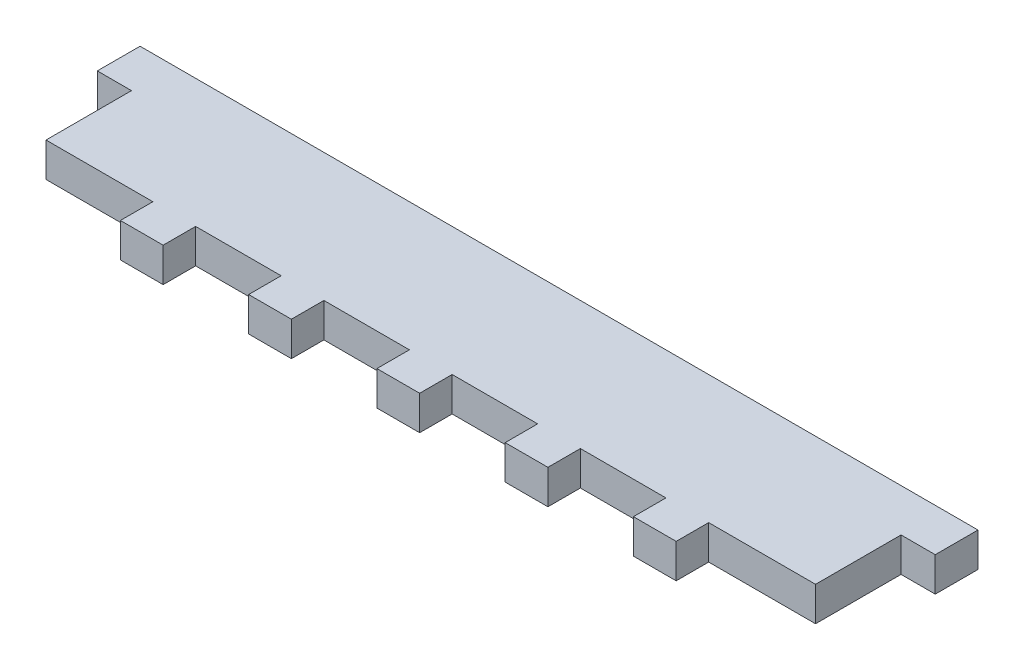
ISO-10303-21;
HEADER;
FILE_DESCRIPTION(('STEP AP214'),'2;1');
FILE_NAME('part.step','',(''),(''),'','','');
FILE_SCHEMA(('AUTOMOTIVE_DESIGN { 1 0 10303 214 1 1 1 1 }'));
ENDSEC;
DATA;
#1=APPLICATION_CONTEXT('core data for automotive mechanical design processes');
#2=APPLICATION_PROTOCOL_DEFINITION('international standard','automotive_design',2000,#1);
#3=PRODUCT_CONTEXT('',#1,'mechanical');
#4=PRODUCT('Part','Part','',(#3));
#5=PRODUCT_RELATED_PRODUCT_CATEGORY('part','',(#4));
#6=PRODUCT_DEFINITION_FORMATION('','',#4);
#7=PRODUCT_DEFINITION_CONTEXT('part definition',#1,'design');
#8=PRODUCT_DEFINITION('design','',#6,#7);
#9=PRODUCT_DEFINITION_SHAPE('','',#8);
#10=(LENGTH_UNIT() NAMED_UNIT(*) SI_UNIT(.MILLI.,.METRE.));
#11=(NAMED_UNIT(*) PLANE_ANGLE_UNIT() SI_UNIT($,.RADIAN.));
#12=(NAMED_UNIT(*) SI_UNIT($,.STERADIAN.) SOLID_ANGLE_UNIT());
#13=UNCERTAINTY_MEASURE_WITH_UNIT(LENGTH_MEASURE(1.E-05),#10,'distance_accuracy_value','');
#14=(GEOMETRIC_REPRESENTATION_CONTEXT(3) GLOBAL_UNCERTAINTY_ASSIGNED_CONTEXT((#13)) GLOBAL_UNIT_ASSIGNED_CONTEXT((#10,
#11,#12)) REPRESENTATION_CONTEXT('',''));
#15=CARTESIAN_POINT('',(0.,0.,0.));
#16=DIRECTION('',(0.,0.,1.));
#17=DIRECTION('',(1.,0.,0.));
#18=AXIS2_PLACEMENT_3D('',#15,#16,#17);
#19=CARTESIAN_POINT('',(0.,5.08,0.));
#20=DIRECTION('',(0.,0.,-1.));
#21=DIRECTION('',(-1.,0.,0.));
#22=AXIS2_PLACEMENT_3D('',#19,#20,#21);
#23=PLANE('',#22);
#24=DIRECTION('',(0.,-1.,0.));
#25=VECTOR('',#24,1.);
#26=CARTESIAN_POINT('',(92.075,5.08,0.));
#27=LINE('',#26,#25);
#28=CARTESIAN_POINT('',(92.075,5.08,0.));
#29=VERTEX_POINT('',#28);
#30=CARTESIAN_POINT('',(92.075,0.,0.));
#31=VERTEX_POINT('',#30);
#32=EDGE_CURVE('E56',#29,#31,#27,.T.);
#33=ORIENTED_EDGE('',*,*,#32,.F.);
#34=DIRECTION('',(1.,0.,0.));
#35=VECTOR('',#34,1.);
#36=CARTESIAN_POINT('',(0.,5.08,0.));
#37=LINE('',#36,#35);
#38=CARTESIAN_POINT('',(79.375,5.08,0.));
#39=VERTEX_POINT('',#38);
#40=EDGE_CURVE('E433',#39,#29,#37,.T.);
#41=ORIENTED_EDGE('',*,*,#40,.F.);
#42=DIRECTION('',(0.,1.,0.));
#43=VECTOR('',#42,1.);
#44=CARTESIAN_POINT('',(79.375,5.08,0.));
#45=LINE('',#44,#43);
#46=CARTESIAN_POINT('',(79.375,0.,0.));
#47=VERTEX_POINT('',#46);
#48=EDGE_CURVE('E245',#47,#39,#45,.T.);
#49=ORIENTED_EDGE('',*,*,#48,.F.);
#50=DIRECTION('',(1.,0.,0.));
#51=VECTOR('',#50,1.);
#52=CARTESIAN_POINT('',(0.,0.,0.));
#53=LINE('',#52,#51);
#54=EDGE_CURVE('E490',#47,#31,#53,.T.);
#55=ORIENTED_EDGE('',*,*,#54,.T.);
#56=EDGE_LOOP('',(#33,#41,#49,#55));
#57=FACE_BOUND('',#56,.T.);
#58=ADVANCED_FACE('F33',(#57),#23,.F.);
#59=DIRECTION('',(0.,1.,0.));
#60=VECTOR('',#59,1.);
#61=CARTESIAN_POINT('',(98.425,5.08,0.));
#62=LINE('',#61,#60);
#63=CARTESIAN_POINT('',(98.425,0.,0.));
#64=VERTEX_POINT('',#63);
#65=CARTESIAN_POINT('',(98.425,5.08,0.));
#66=VERTEX_POINT('',#65);
#67=EDGE_CURVE('E239',#64,#66,#62,.T.);
#68=ORIENTED_EDGE('',*,*,#67,.F.);
#69=CARTESIAN_POINT('',(114.3,0.,0.));
#70=VERTEX_POINT('',#69);
#71=EDGE_CURVE('E379',#64,#70,#53,.T.);
#72=ORIENTED_EDGE('',*,*,#71,.T.);
#73=DIRECTION('',(0.,-1.,0.));
#74=VECTOR('',#73,1.);
#75=CARTESIAN_POINT('',(114.3,5.08,0.));
#76=LINE('',#75,#74);
#77=CARTESIAN_POINT('',(114.3,5.08,0.));
#78=VERTEX_POINT('',#77);
#79=EDGE_CURVE('E41',#78,#70,#76,.T.);
#80=ORIENTED_EDGE('',*,*,#79,.F.);
#81=EDGE_CURVE('E48',#66,#78,#37,.T.);
#82=ORIENTED_EDGE('',*,*,#81,.F.);
#83=EDGE_LOOP('',(#68,#72,#80,#82));
#84=FACE_BOUND('',#83,.T.);
#85=ADVANCED_FACE('F491',(#84),#23,.F.);
#86=DIRECTION('',(0.,-1.,0.));
#87=VECTOR('',#86,1.);
#88=CARTESIAN_POINT('',(73.025,5.08,0.));
#89=LINE('',#88,#87);
#90=CARTESIAN_POINT('',(73.025,5.08,0.));
#91=VERTEX_POINT('',#90);
#92=CARTESIAN_POINT('',(73.025,0.,0.));
#93=VERTEX_POINT('',#92);
#94=EDGE_CURVE('E242',#91,#93,#89,.T.);
#95=ORIENTED_EDGE('',*,*,#94,.F.);
#96=CARTESIAN_POINT('',(60.325,5.08,0.));
#97=VERTEX_POINT('',#96);
#98=EDGE_CURVE('E434',#97,#91,#37,.T.);
#99=ORIENTED_EDGE('',*,*,#98,.F.);
#100=DIRECTION('',(0.,1.,0.));
#101=VECTOR('',#100,1.);
#102=CARTESIAN_POINT('',(60.325,5.08,0.));
#103=LINE('',#102,#101);
#104=CARTESIAN_POINT('',(60.325,0.,0.));
#105=VERTEX_POINT('',#104);
#106=EDGE_CURVE('E279',#105,#97,#103,.T.);
#107=ORIENTED_EDGE('',*,*,#106,.F.);
#108=EDGE_CURVE('E476',#105,#93,#53,.T.);
#109=ORIENTED_EDGE('',*,*,#108,.T.);
#110=EDGE_LOOP('',(#95,#99,#107,#109));
#111=FACE_BOUND('',#110,.T.);
#112=ADVANCED_FACE('F475',(#111),#23,.F.);
#113=DIRECTION('',(0.,-1.,0.));
#114=VECTOR('',#113,1.);
#115=CARTESIAN_POINT('',(53.975,5.08,0.));
#116=LINE('',#115,#114);
#117=CARTESIAN_POINT('',(53.975,5.08,0.));
#118=VERTEX_POINT('',#117);
#119=CARTESIAN_POINT('',(53.975,0.,0.));
#120=VERTEX_POINT('',#119);
#121=EDGE_CURVE('E274',#118,#120,#116,.T.);
#122=ORIENTED_EDGE('',*,*,#121,.F.);
#123=CARTESIAN_POINT('',(41.275,5.08,0.));
#124=VERTEX_POINT('',#123);
#125=EDGE_CURVE('E436',#124,#118,#37,.T.);
#126=ORIENTED_EDGE('',*,*,#125,.F.);
#127=DIRECTION('',(0.,1.,0.));
#128=VECTOR('',#127,1.);
#129=CARTESIAN_POINT('',(41.275,5.08,0.));
#130=LINE('',#129,#128);
#131=CARTESIAN_POINT('',(41.275,0.,0.));
#132=VERTEX_POINT('',#131);
#133=EDGE_CURVE('E306',#132,#124,#130,.T.);
#134=ORIENTED_EDGE('',*,*,#133,.F.);
#135=EDGE_CURVE('E460',#132,#120,#53,.T.);
#136=ORIENTED_EDGE('',*,*,#135,.T.);
#137=EDGE_LOOP('',(#122,#126,#134,#136));
#138=FACE_BOUND('',#137,.T.);
#139=ADVANCED_FACE('F459',(#138),#23,.F.);
#140=DIRECTION('',(0.,-1.,0.));
#141=VECTOR('',#140,1.);
#142=CARTESIAN_POINT('',(34.925,5.08,0.));
#143=LINE('',#142,#141);
#144=CARTESIAN_POINT('',(34.925,5.08,0.));
#145=VERTEX_POINT('',#144);
#146=CARTESIAN_POINT('',(34.925,0.,0.));
#147=VERTEX_POINT('',#146);
#148=EDGE_CURVE('E301',#145,#147,#143,.T.);
#149=ORIENTED_EDGE('',*,*,#148,.F.);
#150=CARTESIAN_POINT('',(22.225,5.08,0.));
#151=VERTEX_POINT('',#150);
#152=EDGE_CURVE('E364',#151,#145,#37,.T.);
#153=ORIENTED_EDGE('',*,*,#152,.F.);
#154=DIRECTION('',(0.,1.,0.));
#155=VECTOR('',#154,1.);
#156=CARTESIAN_POINT('',(22.225,5.08,0.));
#157=LINE('',#156,#155);
#158=CARTESIAN_POINT('',(22.225,0.,0.));
#159=VERTEX_POINT('',#158);
#160=EDGE_CURVE('E333',#159,#151,#157,.T.);
#161=ORIENTED_EDGE('',*,*,#160,.F.);
#162=EDGE_CURVE('E383',#159,#147,#53,.T.);
#163=ORIENTED_EDGE('',*,*,#162,.T.);
#164=EDGE_LOOP('',(#149,#153,#161,#163));
#165=FACE_BOUND('',#164,.T.);
#166=ADVANCED_FACE('F515',(#165),#23,.F.);
#167=DIRECTION('',(0.,-1.,0.));
#168=VECTOR('',#167,1.);
#169=CARTESIAN_POINT('',(15.875,5.08,0.));
#170=LINE('',#169,#168);
#171=CARTESIAN_POINT('',(15.875,5.08,0.));
#172=VERTEX_POINT('',#171);
#173=CARTESIAN_POINT('',(15.875,0.,0.));
#174=VERTEX_POINT('',#173);
#175=EDGE_CURVE('E328',#172,#174,#170,.T.);
#176=ORIENTED_EDGE('',*,*,#175,.F.);
#177=CARTESIAN_POINT('',(0.,5.08,0.));
#178=VERTEX_POINT('',#177);
#179=EDGE_CURVE('E360',#178,#172,#37,.T.);
#180=ORIENTED_EDGE('',*,*,#179,.F.);
#181=DIRECTION('',(0.,-1.,0.));
#182=VECTOR('',#181,1.);
#183=CARTESIAN_POINT('',(0.,5.08,0.));
#184=LINE('',#183,#182);
#185=CARTESIAN_POINT('',(0.,0.,0.));
#186=VERTEX_POINT('',#185);
#187=EDGE_CURVE('E11',#178,#186,#184,.T.);
#188=ORIENTED_EDGE('',*,*,#187,.T.);
#189=EDGE_CURVE('E380',#186,#174,#53,.T.);
#190=ORIENTED_EDGE('',*,*,#189,.T.);
#191=EDGE_LOOP('',(#176,#180,#188,#190));
#192=FACE_BOUND('',#191,.T.);
#193=ADVANCED_FACE('F509',(#192),#23,.F.);
#194=CARTESIAN_POINT('',(0.,5.08,0.));
#195=DIRECTION('',(1.,0.,0.));
#196=DIRECTION('',(0.,0.,-1.));
#197=AXIS2_PLACEMENT_3D('',#194,#195,#196);
#198=PLANE('',#197);
#199=DIRECTION('',(0.,0.,1.));
#200=VECTOR('',#199,1.);
#201=CARTESIAN_POINT('',(0.,0.,0.));
#202=LINE('',#201,#200);
#203=CARTESIAN_POINT('',(0.,0.,-12.7));
#204=VERTEX_POINT('',#203);
#205=EDGE_CURVE('E355',#204,#186,#202,.T.);
#206=ORIENTED_EDGE('',*,*,#205,.T.);
#207=ORIENTED_EDGE('',*,*,#187,.F.);
#208=DIRECTION('',(0.,0.,1.));
#209=VECTOR('',#208,1.);
#210=CARTESIAN_POINT('',(0.,5.08,0.));
#211=LINE('',#210,#209);
#212=CARTESIAN_POINT('',(0.,5.08,-12.7));
#213=VERTEX_POINT('',#212);
#214=EDGE_CURVE('E356',#213,#178,#211,.T.);
#215=ORIENTED_EDGE('',*,*,#214,.F.);
#216=DIRECTION('',(0.,-1.,0.));
#217=VECTOR('',#216,1.);
#218=CARTESIAN_POINT('',(0.,5.08,-12.7));
#219=LINE('',#218,#217);
#220=EDGE_CURVE('E376',#213,#204,#219,.T.);
#221=ORIENTED_EDGE('',*,*,#220,.T.);
#222=EDGE_LOOP('',(#206,#207,#215,#221));
#223=FACE_BOUND('',#222,.T.);
#224=ADVANCED_FACE('F35',(#223),#198,.F.);
#225=CARTESIAN_POINT('',(114.3,5.08,0.));
#226=DIRECTION('',(-1.,0.,0.));
#227=DIRECTION('',(0.,0.,1.));
#228=AXIS2_PLACEMENT_3D('',#225,#226,#227);
#229=PLANE('',#228);
#230=DIRECTION('',(0.,0.,-1.));
#231=VECTOR('',#230,1.);
#232=CARTESIAN_POINT('',(114.3,0.,0.));
#233=LINE('',#232,#231);
#234=CARTESIAN_POINT('',(114.3,0.,-12.7));
#235=VERTEX_POINT('',#234);
#236=EDGE_CURVE('E382',#70,#235,#233,.T.);
#237=ORIENTED_EDGE('',*,*,#236,.T.);
#238=DIRECTION('',(0.,-1.,0.));
#239=VECTOR('',#238,1.);
#240=CARTESIAN_POINT('',(114.3,5.08,-12.7));
#241=LINE('',#240,#239);
#242=CARTESIAN_POINT('',(114.3,5.08,-12.7));
#243=VERTEX_POINT('',#242);
#244=EDGE_CURVE('E409',#243,#235,#241,.T.);
#245=ORIENTED_EDGE('',*,*,#244,.F.);
#246=DIRECTION('',(0.,0.,-1.));
#247=VECTOR('',#246,1.);
#248=CARTESIAN_POINT('',(114.3,5.08,0.));
#249=LINE('',#248,#247);
#250=EDGE_CURVE('E363',#78,#243,#249,.T.);
#251=ORIENTED_EDGE('',*,*,#250,.F.);
#252=ORIENTED_EDGE('',*,*,#79,.T.);
#253=EDGE_LOOP('',(#237,#245,#251,#252));
#254=FACE_BOUND('',#253,.T.);
#255=ADVANCED_FACE('F415',(#254),#229,.F.);
#256=CARTESIAN_POINT('',(114.3,5.08,-12.7));
#257=DIRECTION('',(0.,0.,-1.));
#258=DIRECTION('',(-1.,0.,0.));
#259=AXIS2_PLACEMENT_3D('',#256,#257,#258);
#260=PLANE('',#259);
#261=DIRECTION('',(1.,0.,0.));
#262=VECTOR('',#261,1.);
#263=CARTESIAN_POINT('',(114.3,0.,-12.7));
#264=LINE('',#263,#262);
#265=CARTESIAN_POINT('',(119.38,0.,-12.7));
#266=VERTEX_POINT('',#265);
#267=EDGE_CURVE('E385',#235,#266,#264,.T.);
#268=ORIENTED_EDGE('',*,*,#267,.T.);
#269=DIRECTION('',(0.,-1.,0.));
#270=VECTOR('',#269,1.);
#271=CARTESIAN_POINT('',(119.38,5.08,-12.7));
#272=LINE('',#271,#270);
#273=CARTESIAN_POINT('',(119.38,5.08,-12.7));
#274=VERTEX_POINT('',#273);
#275=EDGE_CURVE('E406',#274,#266,#272,.T.);
#276=ORIENTED_EDGE('',*,*,#275,.F.);
#277=DIRECTION('',(1.,0.,0.));
#278=VECTOR('',#277,1.);
#279=CARTESIAN_POINT('',(114.3,5.08,-12.7));
#280=LINE('',#279,#278);
#281=EDGE_CURVE('E366',#243,#274,#280,.T.);
#282=ORIENTED_EDGE('',*,*,#281,.F.);
#283=ORIENTED_EDGE('',*,*,#244,.T.);
#284=EDGE_LOOP('',(#268,#276,#282,#283));
#285=FACE_BOUND('',#284,.T.);
#286=ADVANCED_FACE('F421',(#285),#260,.F.);
#287=CARTESIAN_POINT('',(119.38,5.08,-19.05));
#288=DIRECTION('',(-1.,0.,0.));
#289=DIRECTION('',(0.,0.,1.));
#290=AXIS2_PLACEMENT_3D('',#287,#288,#289);
#291=PLANE('',#290);
#292=DIRECTION('',(0.,0.,-1.));
#293=VECTOR('',#292,1.);
#294=CARTESIAN_POINT('',(119.38,0.,-19.05));
#295=LINE('',#294,#293);
#296=CARTESIAN_POINT('',(119.38,0.,-19.05));
#297=VERTEX_POINT('',#296);
#298=EDGE_CURVE('E387',#266,#297,#295,.T.);
#299=ORIENTED_EDGE('',*,*,#298,.T.);
#300=DIRECTION('',(0.,-1.,0.));
#301=VECTOR('',#300,1.);
#302=CARTESIAN_POINT('',(119.38,5.08,-19.05));
#303=LINE('',#302,#301);
#304=CARTESIAN_POINT('',(119.38,5.08,-19.05));
#305=VERTEX_POINT('',#304);
#306=EDGE_CURVE('E403',#305,#297,#303,.T.);
#307=ORIENTED_EDGE('',*,*,#306,.F.);
#308=DIRECTION('',(0.,0.,-1.));
#309=VECTOR('',#308,1.);
#310=CARTESIAN_POINT('',(119.38,5.08,-19.05));
#311=LINE('',#310,#309);
#312=EDGE_CURVE('E368',#274,#305,#311,.T.);
#313=ORIENTED_EDGE('',*,*,#312,.F.);
#314=ORIENTED_EDGE('',*,*,#275,.T.);
#315=EDGE_LOOP('',(#299,#307,#313,#314));
#316=FACE_BOUND('',#315,.T.);
#317=ADVANCED_FACE('F425',(#316),#291,.F.);
#318=CARTESIAN_POINT('',(0.,5.08,-19.05));
#319=DIRECTION('',(0.,0.,1.));
#320=DIRECTION('',(1.,0.,0.));
#321=AXIS2_PLACEMENT_3D('',#318,#319,#320);
#322=PLANE('',#321);
#323=DIRECTION('',(-1.,0.,0.));
#324=VECTOR('',#323,1.);
#325=CARTESIAN_POINT('',(0.,0.,-19.05));
#326=LINE('',#325,#324);
#327=CARTESIAN_POINT('',(-5.08,0.,-19.05));
#328=VERTEX_POINT('',#327);
#329=EDGE_CURVE('E390',#297,#328,#326,.T.);
#330=ORIENTED_EDGE('',*,*,#329,.T.);
#331=DIRECTION('',(0.,-1.,0.));
#332=VECTOR('',#331,1.);
#333=CARTESIAN_POINT('',(-5.08,5.08,-19.05));
#334=LINE('',#333,#332);
#335=CARTESIAN_POINT('',(-5.08,5.08,-19.05));
#336=VERTEX_POINT('',#335);
#337=EDGE_CURVE('E400',#336,#328,#334,.T.);
#338=ORIENTED_EDGE('',*,*,#337,.F.);
#339=DIRECTION('',(-1.,0.,0.));
#340=VECTOR('',#339,1.);
#341=CARTESIAN_POINT('',(114.3,5.08,-19.05));
#342=LINE('',#341,#340);
#343=EDGE_CURVE('E370',#305,#336,#342,.T.);
#344=ORIENTED_EDGE('',*,*,#343,.F.);
#345=ORIENTED_EDGE('',*,*,#306,.T.);
#346=EDGE_LOOP('',(#330,#338,#344,#345));
#347=FACE_BOUND('',#346,.T.);
#348=ADVANCED_FACE('F547',(#347),#322,.F.);
#349=CARTESIAN_POINT('',(-5.08,5.08,-19.05));
#350=DIRECTION('',(1.,0.,0.));
#351=DIRECTION('',(0.,0.,-1.));
#352=AXIS2_PLACEMENT_3D('',#349,#350,#351);
#353=PLANE('',#352);
#354=DIRECTION('',(0.,0.,1.));
#355=VECTOR('',#354,1.);
#356=CARTESIAN_POINT('',(-5.08,0.,-19.05));
#357=LINE('',#356,#355);
#358=CARTESIAN_POINT('',(-5.08,0.,-12.7));
#359=VERTEX_POINT('',#358);
#360=EDGE_CURVE('E392',#328,#359,#357,.T.);
#361=ORIENTED_EDGE('',*,*,#360,.T.);
#362=DIRECTION('',(0.,-1.,0.));
#363=VECTOR('',#362,1.);
#364=CARTESIAN_POINT('',(-5.08,5.08,-12.7));
#365=LINE('',#364,#363);
#366=CARTESIAN_POINT('',(-5.08,5.08,-12.7));
#367=VERTEX_POINT('',#366);
#368=EDGE_CURVE('E397',#367,#359,#365,.T.);
#369=ORIENTED_EDGE('',*,*,#368,.F.);
#370=DIRECTION('',(0.,0.,1.));
#371=VECTOR('',#370,1.);
#372=CARTESIAN_POINT('',(-5.08,5.08,-19.05));
#373=LINE('',#372,#371);
#374=EDGE_CURVE('E372',#336,#367,#373,.T.);
#375=ORIENTED_EDGE('',*,*,#374,.F.);
#376=ORIENTED_EDGE('',*,*,#337,.T.);
#377=EDGE_LOOP('',(#361,#369,#375,#376));
#378=FACE_BOUND('',#377,.T.);
#379=ADVANCED_FACE('F544',(#378),#353,.F.);
#380=CARTESIAN_POINT('',(0.,5.08,-12.7));
#381=DIRECTION('',(0.,0.,-1.));
#382=DIRECTION('',(-1.,0.,0.));
#383=AXIS2_PLACEMENT_3D('',#380,#381,#382);
#384=PLANE('',#383);
#385=DIRECTION('',(1.,0.,0.));
#386=VECTOR('',#385,1.);
#387=CARTESIAN_POINT('',(0.,0.,-12.7));
#388=LINE('',#387,#386);
#389=EDGE_CURVE('E359',#359,#204,#388,.T.);
#390=ORIENTED_EDGE('',*,*,#389,.T.);
#391=ORIENTED_EDGE('',*,*,#220,.F.);
#392=DIRECTION('',(1.,0.,0.));
#393=VECTOR('',#392,1.);
#394=CARTESIAN_POINT('',(0.,5.08,-12.7));
#395=LINE('',#394,#393);
#396=EDGE_CURVE('E374',#367,#213,#395,.T.);
#397=ORIENTED_EDGE('',*,*,#396,.F.);
#398=ORIENTED_EDGE('',*,*,#368,.T.);
#399=EDGE_LOOP('',(#390,#391,#397,#398));
#400=FACE_BOUND('',#399,.T.);
#401=ADVANCED_FACE('F540',(#400),#384,.F.);
#402=CARTESIAN_POINT('',(0.,5.08,0.));
#403=DIRECTION('',(0.,1.,0.));
#404=DIRECTION('',(0.,0.,1.));
#405=AXIS2_PLACEMENT_3D('',#402,#403,#404);
#406=PLANE('',#405);
#407=ORIENTED_EDGE('',*,*,#214,.T.);
#408=ORIENTED_EDGE('',*,*,#179,.T.);
#409=DIRECTION('',(0.,0.,-1.));
#410=VECTOR('',#409,1.);
#411=CARTESIAN_POINT('',(15.875,5.08,4.826));
#412=LINE('',#411,#410);
#413=CARTESIAN_POINT('',(15.875,5.08,4.826));
#414=VERTEX_POINT('',#413);
#415=EDGE_CURVE('E339',#414,#172,#412,.T.);
#416=ORIENTED_EDGE('',*,*,#415,.F.);
#417=DIRECTION('',(-1.,0.,0.));
#418=VECTOR('',#417,1.);
#419=CARTESIAN_POINT('',(15.875,5.08,4.826));
#420=LINE('',#419,#418);
#421=CARTESIAN_POINT('',(22.225,5.08,4.826));
#422=VERTEX_POINT('',#421);
#423=EDGE_CURVE('E337',#422,#414,#420,.T.);
#424=ORIENTED_EDGE('',*,*,#423,.F.);
#425=DIRECTION('',(0.,0.,-1.));
#426=VECTOR('',#425,1.);
#427=CARTESIAN_POINT('',(22.225,5.08,4.826));
#428=LINE('',#427,#426);
#429=EDGE_CURVE('E346',#422,#151,#428,.T.);
#430=ORIENTED_EDGE('',*,*,#429,.T.);
#431=ORIENTED_EDGE('',*,*,#152,.T.);
#432=DIRECTION('',(0.,0.,-1.));
#433=VECTOR('',#432,1.);
#434=CARTESIAN_POINT('',(34.925,5.08,4.826));
#435=LINE('',#434,#433);
#436=CARTESIAN_POINT('',(34.925,5.08,4.826));
#437=VERTEX_POINT('',#436);
#438=EDGE_CURVE('E312',#437,#145,#435,.T.);
#439=ORIENTED_EDGE('',*,*,#438,.F.);
#440=DIRECTION('',(-1.,0.,0.));
#441=VECTOR('',#440,1.);
#442=CARTESIAN_POINT('',(34.925,5.08,4.826));
#443=LINE('',#442,#441);
#444=CARTESIAN_POINT('',(41.275,5.08,4.826));
#445=VERTEX_POINT('',#444);
#446=EDGE_CURVE('E310',#445,#437,#443,.T.);
#447=ORIENTED_EDGE('',*,*,#446,.F.);
#448=DIRECTION('',(0.,0.,-1.));
#449=VECTOR('',#448,1.);
#450=CARTESIAN_POINT('',(41.275,5.08,4.826));
#451=LINE('',#450,#449);
#452=EDGE_CURVE('E319',#445,#124,#451,.T.);
#453=ORIENTED_EDGE('',*,*,#452,.T.);
#454=ORIENTED_EDGE('',*,*,#125,.T.);
#455=DIRECTION('',(0.,0.,-1.));
#456=VECTOR('',#455,1.);
#457=CARTESIAN_POINT('',(53.975,5.08,4.826));
#458=LINE('',#457,#456);
#459=CARTESIAN_POINT('',(53.975,5.08,4.826));
#460=VERTEX_POINT('',#459);
#461=EDGE_CURVE('E285',#460,#118,#458,.T.);
#462=ORIENTED_EDGE('',*,*,#461,.F.);
#463=DIRECTION('',(-1.,0.,0.));
#464=VECTOR('',#463,1.);
#465=CARTESIAN_POINT('',(53.975,5.08,4.826));
#466=LINE('',#465,#464);
#467=CARTESIAN_POINT('',(60.325,5.08,4.826));
#468=VERTEX_POINT('',#467);
#469=EDGE_CURVE('E283',#468,#460,#466,.T.);
#470=ORIENTED_EDGE('',*,*,#469,.F.);
#471=DIRECTION('',(0.,0.,-1.));
#472=VECTOR('',#471,1.);
#473=CARTESIAN_POINT('',(60.325,5.08,4.826));
#474=LINE('',#473,#472);
#475=EDGE_CURVE('E292',#468,#97,#474,.T.);
#476=ORIENTED_EDGE('',*,*,#475,.T.);
#477=ORIENTED_EDGE('',*,*,#98,.T.);
#478=DIRECTION('',(0.,0.,-1.));
#479=VECTOR('',#478,1.);
#480=CARTESIAN_POINT('',(73.025,5.08,4.826));
#481=LINE('',#480,#479);
#482=CARTESIAN_POINT('',(73.025,5.08,4.826));
#483=VERTEX_POINT('',#482);
#484=EDGE_CURVE('E259',#483,#91,#481,.T.);
#485=ORIENTED_EDGE('',*,*,#484,.F.);
#486=DIRECTION('',(-1.,0.,0.));
#487=VECTOR('',#486,1.);
#488=CARTESIAN_POINT('',(73.025,5.08,4.826));
#489=LINE('',#488,#487);
#490=CARTESIAN_POINT('',(79.375,5.08,4.826));
#491=VERTEX_POINT('',#490);
#492=EDGE_CURVE('E258',#491,#483,#489,.T.);
#493=ORIENTED_EDGE('',*,*,#492,.F.);
#494=DIRECTION('',(0.,0.,-1.));
#495=VECTOR('',#494,1.);
#496=CARTESIAN_POINT('',(79.375,5.08,4.826));
#497=LINE('',#496,#495);
#498=EDGE_CURVE('E265',#491,#39,#497,.T.);
#499=ORIENTED_EDGE('',*,*,#498,.T.);
#500=ORIENTED_EDGE('',*,*,#40,.T.);
#501=DIRECTION('',(0.,0.,-1.));
#502=VECTOR('',#501,1.);
#503=CARTESIAN_POINT('',(92.075,5.08,4.826));
#504=LINE('',#503,#502);
#505=CARTESIAN_POINT('',(92.075,5.08,4.826));
#506=VERTEX_POINT('',#505);
#507=EDGE_CURVE('E496',#506,#29,#504,.T.);
#508=ORIENTED_EDGE('',*,*,#507,.F.);
#509=DIRECTION('',(-1.,0.,0.));
#510=VECTOR('',#509,1.);
#511=CARTESIAN_POINT('',(92.075,5.08,4.826));
#512=LINE('',#511,#510);
#513=CARTESIAN_POINT('',(98.425,5.08,4.826));
#514=VERTEX_POINT('',#513);
#515=EDGE_CURVE('E235',#514,#506,#512,.T.);
#516=ORIENTED_EDGE('',*,*,#515,.F.);
#517=DIRECTION('',(0.,0.,-1.));
#518=VECTOR('',#517,1.);
#519=CARTESIAN_POINT('',(98.425,5.08,4.826));
#520=LINE('',#519,#518);
#521=EDGE_CURVE('E247',#514,#66,#520,.T.);
#522=ORIENTED_EDGE('',*,*,#521,.T.);
#523=ORIENTED_EDGE('',*,*,#81,.T.);
#524=ORIENTED_EDGE('',*,*,#250,.T.);
#525=ORIENTED_EDGE('',*,*,#281,.T.);
#526=ORIENTED_EDGE('',*,*,#312,.T.);
#527=ORIENTED_EDGE('',*,*,#343,.T.);
#528=ORIENTED_EDGE('',*,*,#374,.T.);
#529=ORIENTED_EDGE('',*,*,#396,.T.);
#530=EDGE_LOOP('',(#407,#408,#416,#424,#430,#431,#439,#447,#453,#454,#462,#470,#476,#477,#485,
#493,#499,#500,#508,#516,#522,#523,#524,#525,#526,#527,#528,#529));
#531=FACE_BOUND('',#530,.T.);
#532=ADVANCED_FACE('F429',(#531),#406,.T.);
#533=CARTESIAN_POINT('',(0.,0.,0.));
#534=DIRECTION('',(0.,1.,0.));
#535=DIRECTION('',(0.,0.,1.));
#536=AXIS2_PLACEMENT_3D('',#533,#534,#535);
#537=PLANE('',#536);
#538=ORIENTED_EDGE('',*,*,#205,.F.);
#539=ORIENTED_EDGE('',*,*,#389,.F.);
#540=ORIENTED_EDGE('',*,*,#360,.F.);
#541=ORIENTED_EDGE('',*,*,#329,.F.);
#542=ORIENTED_EDGE('',*,*,#298,.F.);
#543=ORIENTED_EDGE('',*,*,#267,.F.);
#544=ORIENTED_EDGE('',*,*,#236,.F.);
#545=ORIENTED_EDGE('',*,*,#71,.F.);
#546=DIRECTION('',(0.,0.,-1.));
#547=VECTOR('',#546,1.);
#548=CARTESIAN_POINT('',(98.425,0.,4.826));
#549=LINE('',#548,#547);
#550=CARTESIAN_POINT('',(98.425,0.,4.826));
#551=VERTEX_POINT('',#550);
#552=EDGE_CURVE('E226',#551,#64,#549,.T.);
#553=ORIENTED_EDGE('',*,*,#552,.F.);
#554=DIRECTION('',(1.,0.,0.));
#555=VECTOR('',#554,1.);
#556=CARTESIAN_POINT('',(92.075,0.,4.826));
#557=LINE('',#556,#555);
#558=CARTESIAN_POINT('',(92.075,0.,4.826));
#559=VERTEX_POINT('',#558);
#560=EDGE_CURVE('E219',#559,#551,#557,.T.);
#561=ORIENTED_EDGE('',*,*,#560,.F.);
#562=DIRECTION('',(0.,0.,-1.));
#563=VECTOR('',#562,1.);
#564=CARTESIAN_POINT('',(92.075,0.,4.826));
#565=LINE('',#564,#563);
#566=EDGE_CURVE('E224',#559,#31,#565,.T.);
#567=ORIENTED_EDGE('',*,*,#566,.T.);
#568=ORIENTED_EDGE('',*,*,#54,.F.);
#569=DIRECTION('',(0.,0.,-1.));
#570=VECTOR('',#569,1.);
#571=CARTESIAN_POINT('',(79.375,0.,4.826));
#572=LINE('',#571,#570);
#573=CARTESIAN_POINT('',(79.375,0.,4.826));
#574=VERTEX_POINT('',#573);
#575=EDGE_CURVE('E268',#574,#47,#572,.T.);
#576=ORIENTED_EDGE('',*,*,#575,.F.);
#577=DIRECTION('',(1.,0.,0.));
#578=VECTOR('',#577,1.);
#579=CARTESIAN_POINT('',(73.025,0.,4.826));
#580=LINE('',#579,#578);
#581=CARTESIAN_POINT('',(73.025,0.,4.826));
#582=VERTEX_POINT('',#581);
#583=EDGE_CURVE('E254',#582,#574,#580,.T.);
#584=ORIENTED_EDGE('',*,*,#583,.F.);
#585=DIRECTION('',(0.,0.,-1.));
#586=VECTOR('',#585,1.);
#587=CARTESIAN_POINT('',(73.025,0.,4.826));
#588=LINE('',#587,#586);
#589=EDGE_CURVE('E271',#582,#93,#588,.T.);
#590=ORIENTED_EDGE('',*,*,#589,.T.);
#591=ORIENTED_EDGE('',*,*,#108,.F.);
#592=DIRECTION('',(0.,0.,-1.));
#593=VECTOR('',#592,1.);
#594=CARTESIAN_POINT('',(60.325,0.,4.826));
#595=LINE('',#594,#593);
#596=CARTESIAN_POINT('',(60.325,0.,4.826));
#597=VERTEX_POINT('',#596);
#598=EDGE_CURVE('E295',#597,#105,#595,.T.);
#599=ORIENTED_EDGE('',*,*,#598,.F.);
#600=DIRECTION('',(1.,0.,0.));
#601=VECTOR('',#600,1.);
#602=CARTESIAN_POINT('',(53.975,0.,4.826));
#603=LINE('',#602,#601);
#604=CARTESIAN_POINT('',(53.975,0.,4.826));
#605=VERTEX_POINT('',#604);
#606=EDGE_CURVE('E278',#605,#597,#603,.T.);
#607=ORIENTED_EDGE('',*,*,#606,.F.);
#608=DIRECTION('',(0.,0.,-1.));
#609=VECTOR('',#608,1.);
#610=CARTESIAN_POINT('',(53.975,0.,4.826));
#611=LINE('',#610,#609);
#612=EDGE_CURVE('E298',#605,#120,#611,.T.);
#613=ORIENTED_EDGE('',*,*,#612,.T.);
#614=ORIENTED_EDGE('',*,*,#135,.F.);
#615=DIRECTION('',(0.,0.,-1.));
#616=VECTOR('',#615,1.);
#617=CARTESIAN_POINT('',(41.275,0.,4.826));
#618=LINE('',#617,#616);
#619=CARTESIAN_POINT('',(41.275,0.,4.826));
#620=VERTEX_POINT('',#619);
#621=EDGE_CURVE('E322',#620,#132,#618,.T.);
#622=ORIENTED_EDGE('',*,*,#621,.F.);
#623=DIRECTION('',(1.,0.,0.));
#624=VECTOR('',#623,1.);
#625=CARTESIAN_POINT('',(34.925,0.,4.826));
#626=LINE('',#625,#624);
#627=CARTESIAN_POINT('',(34.925,0.,4.826));
#628=VERTEX_POINT('',#627);
#629=EDGE_CURVE('E305',#628,#620,#626,.T.);
#630=ORIENTED_EDGE('',*,*,#629,.F.);
#631=DIRECTION('',(0.,0.,-1.));
#632=VECTOR('',#631,1.);
#633=CARTESIAN_POINT('',(34.925,0.,4.826));
#634=LINE('',#633,#632);
#635=EDGE_CURVE('E325',#628,#147,#634,.T.);
#636=ORIENTED_EDGE('',*,*,#635,.T.);
#637=ORIENTED_EDGE('',*,*,#162,.F.);
#638=DIRECTION('',(0.,0.,-1.));
#639=VECTOR('',#638,1.);
#640=CARTESIAN_POINT('',(22.225,0.,4.826));
#641=LINE('',#640,#639);
#642=CARTESIAN_POINT('',(22.225,0.,4.826));
#643=VERTEX_POINT('',#642);
#644=EDGE_CURVE('E349',#643,#159,#641,.T.);
#645=ORIENTED_EDGE('',*,*,#644,.F.);
#646=DIRECTION('',(1.,0.,0.));
#647=VECTOR('',#646,1.);
#648=CARTESIAN_POINT('',(15.875,0.,4.826));
#649=LINE('',#648,#647);
#650=CARTESIAN_POINT('',(15.875,0.,4.826));
#651=VERTEX_POINT('',#650);
#652=EDGE_CURVE('E332',#651,#643,#649,.T.);
#653=ORIENTED_EDGE('',*,*,#652,.F.);
#654=DIRECTION('',(0.,0.,-1.));
#655=VECTOR('',#654,1.);
#656=CARTESIAN_POINT('',(15.875,0.,4.826));
#657=LINE('',#656,#655);
#658=EDGE_CURVE('E352',#651,#174,#657,.T.);
#659=ORIENTED_EDGE('',*,*,#658,.T.);
#660=ORIENTED_EDGE('',*,*,#189,.F.);
#661=EDGE_LOOP('',(#538,#539,#540,#541,#542,#543,#544,#545,#553,#561,#567,#568,#576,#584,#590,
#591,#599,#607,#613,#614,#622,#630,#636,#637,#645,#653,#659,#660));
#662=FACE_BOUND('',#661,.T.);
#663=ADVANCED_FACE('F222',(#662),#537,.F.);
#664=CARTESIAN_POINT('',(15.875,5.08,4.826));
#665=DIRECTION('',(1.,0.,0.));
#666=DIRECTION('',(0.,0.,-1.));
#667=AXIS2_PLACEMENT_3D('',#664,#665,#666);
#668=PLANE('',#667);
#669=ORIENTED_EDGE('',*,*,#175,.T.);
#670=ORIENTED_EDGE('',*,*,#658,.F.);
#671=DIRECTION('',(0.,-1.,0.));
#672=VECTOR('',#671,1.);
#673=CARTESIAN_POINT('',(15.875,5.08,4.826));
#674=LINE('',#673,#672);
#675=EDGE_CURVE('E329',#414,#651,#674,.T.);
#676=ORIENTED_EDGE('',*,*,#675,.F.);
#677=ORIENTED_EDGE('',*,*,#415,.T.);
#678=EDGE_LOOP('',(#669,#670,#676,#677));
#679=FACE_BOUND('',#678,.T.);
#680=ADVANCED_FACE('F528',(#679),#668,.F.);
#681=CARTESIAN_POINT('',(22.225,5.08,4.826));
#682=DIRECTION('',(-1.,0.,0.));
#683=DIRECTION('',(0.,0.,1.));
#684=AXIS2_PLACEMENT_3D('',#681,#682,#683);
#685=PLANE('',#684);
#686=ORIENTED_EDGE('',*,*,#160,.T.);
#687=ORIENTED_EDGE('',*,*,#429,.F.);
#688=DIRECTION('',(0.,1.,0.));
#689=VECTOR('',#688,1.);
#690=CARTESIAN_POINT('',(22.225,5.08,4.826));
#691=LINE('',#690,#689);
#692=EDGE_CURVE('E335',#643,#422,#691,.T.);
#693=ORIENTED_EDGE('',*,*,#692,.F.);
#694=ORIENTED_EDGE('',*,*,#644,.T.);
#695=EDGE_LOOP('',(#686,#687,#693,#694));
#696=FACE_BOUND('',#695,.T.);
#697=ADVANCED_FACE('F534',(#696),#685,.F.);
#698=CARTESIAN_POINT('',(0.,0.,4.826));
#699=DIRECTION('',(0.,0.,1.));
#700=DIRECTION('',(1.,0.,0.));
#701=AXIS2_PLACEMENT_3D('',#698,#699,#700);
#702=PLANE('',#701);
#703=ORIENTED_EDGE('',*,*,#675,.T.);
#704=ORIENTED_EDGE('',*,*,#652,.T.);
#705=ORIENTED_EDGE('',*,*,#692,.T.);
#706=ORIENTED_EDGE('',*,*,#423,.T.);
#707=EDGE_LOOP('',(#703,#704,#705,#706));
#708=FACE_BOUND('',#707,.T.);
#709=ADVANCED_FACE('F530',(#708),#702,.T.);
#710=CARTESIAN_POINT('',(34.925,5.08,4.826));
#711=DIRECTION('',(1.,0.,0.));
#712=DIRECTION('',(0.,0.,-1.));
#713=AXIS2_PLACEMENT_3D('',#710,#711,#712);
#714=PLANE('',#713);
#715=ORIENTED_EDGE('',*,*,#148,.T.);
#716=ORIENTED_EDGE('',*,*,#635,.F.);
#717=DIRECTION('',(0.,-1.,0.));
#718=VECTOR('',#717,1.);
#719=CARTESIAN_POINT('',(34.925,5.08,4.826));
#720=LINE('',#719,#718);
#721=EDGE_CURVE('E302',#437,#628,#720,.T.);
#722=ORIENTED_EDGE('',*,*,#721,.F.);
#723=ORIENTED_EDGE('',*,*,#438,.T.);
#724=EDGE_LOOP('',(#715,#716,#722,#723));
#725=FACE_BOUND('',#724,.T.);
#726=ADVANCED_FACE('F448',(#725),#714,.F.);
#727=CARTESIAN_POINT('',(41.275,5.08,4.826));
#728=DIRECTION('',(-1.,0.,0.));
#729=DIRECTION('',(0.,0.,1.));
#730=AXIS2_PLACEMENT_3D('',#727,#728,#729);
#731=PLANE('',#730);
#732=ORIENTED_EDGE('',*,*,#133,.T.);
#733=ORIENTED_EDGE('',*,*,#452,.F.);
#734=DIRECTION('',(0.,1.,0.));
#735=VECTOR('',#734,1.);
#736=CARTESIAN_POINT('',(41.275,5.08,4.826));
#737=LINE('',#736,#735);
#738=EDGE_CURVE('E308',#620,#445,#737,.T.);
#739=ORIENTED_EDGE('',*,*,#738,.F.);
#740=ORIENTED_EDGE('',*,*,#621,.T.);
#741=EDGE_LOOP('',(#732,#733,#739,#740));
#742=FACE_BOUND('',#741,.T.);
#743=ADVANCED_FACE('F456',(#742),#731,.F.);
#744=CARTESIAN_POINT('',(19.05,0.,4.826));
#745=DIRECTION('',(0.,0.,1.));
#746=DIRECTION('',(1.,0.,0.));
#747=AXIS2_PLACEMENT_3D('',#744,#745,#746);
#748=PLANE('',#747);
#749=ORIENTED_EDGE('',*,*,#721,.T.);
#750=ORIENTED_EDGE('',*,*,#629,.T.);
#751=ORIENTED_EDGE('',*,*,#738,.T.);
#752=ORIENTED_EDGE('',*,*,#446,.T.);
#753=EDGE_LOOP('',(#749,#750,#751,#752));
#754=FACE_BOUND('',#753,.T.);
#755=ADVANCED_FACE('F451',(#754),#748,.T.);
#756=CARTESIAN_POINT('',(53.975,5.08,4.826));
#757=DIRECTION('',(1.,0.,0.));
#758=DIRECTION('',(0.,0.,-1.));
#759=AXIS2_PLACEMENT_3D('',#756,#757,#758);
#760=PLANE('',#759);
#761=ORIENTED_EDGE('',*,*,#121,.T.);
#762=ORIENTED_EDGE('',*,*,#612,.F.);
#763=DIRECTION('',(0.,-1.,0.));
#764=VECTOR('',#763,1.);
#765=CARTESIAN_POINT('',(53.975,5.08,4.826));
#766=LINE('',#765,#764);
#767=EDGE_CURVE('E275',#460,#605,#766,.T.);
#768=ORIENTED_EDGE('',*,*,#767,.F.);
#769=ORIENTED_EDGE('',*,*,#461,.T.);
#770=EDGE_LOOP('',(#761,#762,#768,#769));
#771=FACE_BOUND('',#770,.T.);
#772=ADVANCED_FACE('F463',(#771),#760,.F.);
#773=CARTESIAN_POINT('',(60.325,5.08,4.826));
#774=DIRECTION('',(-1.,0.,0.));
#775=DIRECTION('',(0.,0.,1.));
#776=AXIS2_PLACEMENT_3D('',#773,#774,#775);
#777=PLANE('',#776);
#778=ORIENTED_EDGE('',*,*,#106,.T.);
#779=ORIENTED_EDGE('',*,*,#475,.F.);
#780=DIRECTION('',(0.,1.,0.));
#781=VECTOR('',#780,1.);
#782=CARTESIAN_POINT('',(60.325,5.08,4.826));
#783=LINE('',#782,#781);
#784=EDGE_CURVE('E281',#597,#468,#783,.T.);
#785=ORIENTED_EDGE('',*,*,#784,.F.);
#786=ORIENTED_EDGE('',*,*,#598,.T.);
#787=EDGE_LOOP('',(#778,#779,#785,#786));
#788=FACE_BOUND('',#787,.T.);
#789=ADVANCED_FACE('F472',(#788),#777,.F.);
#790=CARTESIAN_POINT('',(38.1,0.,4.826));
#791=DIRECTION('',(0.,0.,1.));
#792=DIRECTION('',(1.,0.,0.));
#793=AXIS2_PLACEMENT_3D('',#790,#791,#792);
#794=PLANE('',#793);
#795=ORIENTED_EDGE('',*,*,#767,.T.);
#796=ORIENTED_EDGE('',*,*,#606,.T.);
#797=ORIENTED_EDGE('',*,*,#784,.T.);
#798=ORIENTED_EDGE('',*,*,#469,.T.);
#799=EDGE_LOOP('',(#795,#796,#797,#798));
#800=FACE_BOUND('',#799,.T.);
#801=ADVANCED_FACE('F468',(#800),#794,.T.);
#802=CARTESIAN_POINT('',(73.025,5.08,4.826));
#803=DIRECTION('',(1.,0.,0.));
#804=DIRECTION('',(0.,0.,-1.));
#805=AXIS2_PLACEMENT_3D('',#802,#803,#804);
#806=PLANE('',#805);
#807=ORIENTED_EDGE('',*,*,#94,.T.);
#808=ORIENTED_EDGE('',*,*,#589,.F.);
#809=DIRECTION('',(0.,-1.,0.));
#810=VECTOR('',#809,1.);
#811=CARTESIAN_POINT('',(73.025,5.08,4.826));
#812=LINE('',#811,#810);
#813=EDGE_CURVE('E251',#483,#582,#812,.T.);
#814=ORIENTED_EDGE('',*,*,#813,.F.);
#815=ORIENTED_EDGE('',*,*,#484,.T.);
#816=EDGE_LOOP('',(#807,#808,#814,#815));
#817=FACE_BOUND('',#816,.T.);
#818=ADVANCED_FACE('F479',(#817),#806,.F.);
#819=CARTESIAN_POINT('',(79.375,5.08,4.826));
#820=DIRECTION('',(-1.,0.,0.));
#821=DIRECTION('',(0.,0.,1.));
#822=AXIS2_PLACEMENT_3D('',#819,#820,#821);
#823=PLANE('',#822);
#824=ORIENTED_EDGE('',*,*,#48,.T.);
#825=ORIENTED_EDGE('',*,*,#498,.F.);
#826=DIRECTION('',(0.,1.,0.));
#827=VECTOR('',#826,1.);
#828=CARTESIAN_POINT('',(79.375,5.08,4.826));
#829=LINE('',#828,#827);
#830=EDGE_CURVE('E256',#574,#491,#829,.T.);
#831=ORIENTED_EDGE('',*,*,#830,.F.);
#832=ORIENTED_EDGE('',*,*,#575,.T.);
#833=EDGE_LOOP('',(#824,#825,#831,#832));
#834=FACE_BOUND('',#833,.T.);
#835=ADVANCED_FACE('F488',(#834),#823,.F.);
#836=CARTESIAN_POINT('',(57.15,0.,4.826));
#837=DIRECTION('',(0.,0.,1.));
#838=DIRECTION('',(1.,0.,0.));
#839=AXIS2_PLACEMENT_3D('',#836,#837,#838);
#840=PLANE('',#839);
#841=ORIENTED_EDGE('',*,*,#813,.T.);
#842=ORIENTED_EDGE('',*,*,#583,.T.);
#843=ORIENTED_EDGE('',*,*,#830,.T.);
#844=ORIENTED_EDGE('',*,*,#492,.T.);
#845=EDGE_LOOP('',(#841,#842,#843,#844));
#846=FACE_BOUND('',#845,.T.);
#847=ADVANCED_FACE('F484',(#846),#840,.T.);
#848=CARTESIAN_POINT('',(92.075,5.08,4.826));
#849=DIRECTION('',(1.,0.,0.));
#850=DIRECTION('',(0.,0.,-1.));
#851=AXIS2_PLACEMENT_3D('',#848,#849,#850);
#852=PLANE('',#851);
#853=ORIENTED_EDGE('',*,*,#32,.T.);
#854=ORIENTED_EDGE('',*,*,#566,.F.);
#855=DIRECTION('',(0.,-1.,0.));
#856=VECTOR('',#855,1.);
#857=CARTESIAN_POINT('',(92.075,5.08,4.826));
#858=LINE('',#857,#856);
#859=EDGE_CURVE('E230',#506,#559,#858,.T.);
#860=ORIENTED_EDGE('',*,*,#859,.F.);
#861=ORIENTED_EDGE('',*,*,#507,.T.);
#862=EDGE_LOOP('',(#853,#854,#860,#861));
#863=FACE_BOUND('',#862,.T.);
#864=ADVANCED_FACE('F241',(#863),#852,.F.);
#865=CARTESIAN_POINT('',(98.425,5.08,4.826));
#866=DIRECTION('',(-1.,0.,0.));
#867=DIRECTION('',(0.,0.,1.));
#868=AXIS2_PLACEMENT_3D('',#865,#866,#867);
#869=PLANE('',#868);
#870=ORIENTED_EDGE('',*,*,#67,.T.);
#871=ORIENTED_EDGE('',*,*,#521,.F.);
#872=DIRECTION('',(0.,1.,0.));
#873=VECTOR('',#872,1.);
#874=CARTESIAN_POINT('',(98.425,5.08,4.826));
#875=LINE('',#874,#873);
#876=EDGE_CURVE('E229',#551,#514,#875,.T.);
#877=ORIENTED_EDGE('',*,*,#876,.F.);
#878=ORIENTED_EDGE('',*,*,#552,.T.);
#879=EDGE_LOOP('',(#870,#871,#877,#878));
#880=FACE_BOUND('',#879,.T.);
#881=ADVANCED_FACE('F494',(#880),#869,.F.);
#882=CARTESIAN_POINT('',(76.2,0.,4.826));
#883=DIRECTION('',(0.,0.,1.));
#884=DIRECTION('',(1.,0.,0.));
#885=AXIS2_PLACEMENT_3D('',#882,#883,#884);
#886=PLANE('',#885);
#887=ORIENTED_EDGE('',*,*,#859,.T.);
#888=ORIENTED_EDGE('',*,*,#560,.T.);
#889=ORIENTED_EDGE('',*,*,#876,.T.);
#890=ORIENTED_EDGE('',*,*,#515,.T.);
#891=EDGE_LOOP('',(#887,#888,#889,#890));
#892=FACE_BOUND('',#891,.T.);
#893=ADVANCED_FACE('F233',(#892),#886,.T.);
#894=CLOSED_SHELL('',(#58,#85,#112,#139,#166,#193,#224,#255,#286,#317,#348,#379,#401,#532,#663,
#680,#697,#709,#726,#743,#755,#772,#789,#801,#818,#835,#847,#864,#881,#893));
#895=MANIFOLD_SOLID_BREP('B2',#894);
#896=ADVANCED_BREP_SHAPE_REPRESENTATION('',(#18,#895),#14);
#897=SHAPE_DEFINITION_REPRESENTATION(#9,#896);
ENDSEC;
END-ISO-10303-21;
